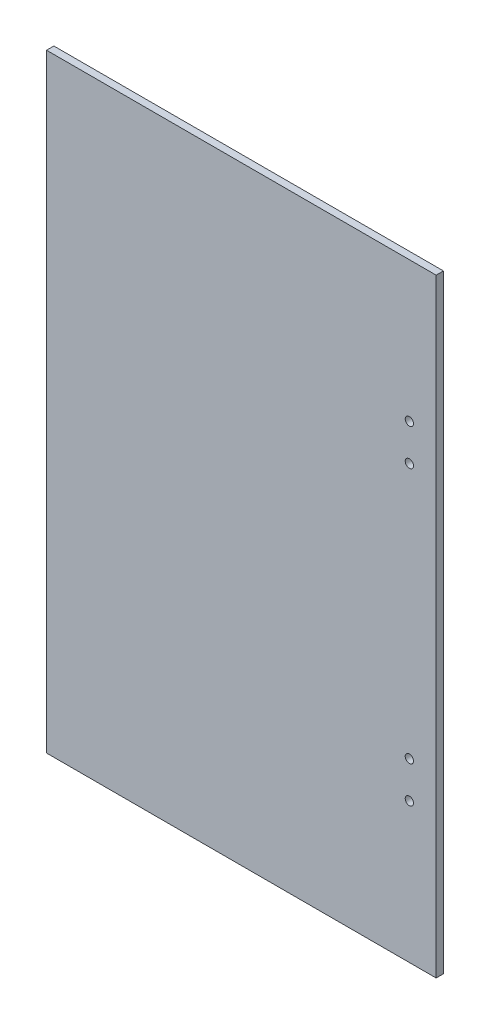
ISO-10303-21;
HEADER;
FILE_DESCRIPTION(('STEP AP214'),'2;1');
FILE_NAME('part.step','',(''),(''),'','','');
FILE_SCHEMA(('AUTOMOTIVE_DESIGN { 1 0 10303 214 1 1 1 1 }'));
ENDSEC;
DATA;
#1=APPLICATION_CONTEXT('core data for automotive mechanical design processes');
#2=APPLICATION_PROTOCOL_DEFINITION('international standard','automotive_design',2000,#1);
#3=PRODUCT_CONTEXT('',#1,'mechanical');
#4=PRODUCT('Part','Part','',(#3));
#5=PRODUCT_RELATED_PRODUCT_CATEGORY('part','',(#4));
#6=PRODUCT_DEFINITION_FORMATION('','',#4);
#7=PRODUCT_DEFINITION_CONTEXT('part definition',#1,'design');
#8=PRODUCT_DEFINITION('design','',#6,#7);
#9=PRODUCT_DEFINITION_SHAPE('','',#8);
#10=(LENGTH_UNIT() NAMED_UNIT(*) SI_UNIT(.MILLI.,.METRE.));
#11=(NAMED_UNIT(*) PLANE_ANGLE_UNIT() SI_UNIT($,.RADIAN.));
#12=(NAMED_UNIT(*) SI_UNIT($,.STERADIAN.) SOLID_ANGLE_UNIT());
#13=UNCERTAINTY_MEASURE_WITH_UNIT(LENGTH_MEASURE(1.E-05),#10,'distance_accuracy_value','');
#14=(GEOMETRIC_REPRESENTATION_CONTEXT(3) GLOBAL_UNCERTAINTY_ASSIGNED_CONTEXT((#13)) GLOBAL_UNIT_ASSIGNED_CONTEXT((#10,
#11,#12)) REPRESENTATION_CONTEXT('',''));
#15=CARTESIAN_POINT('',(0.,0.,0.));
#16=DIRECTION('',(0.,0.,1.));
#17=DIRECTION('',(1.,0.,0.));
#18=AXIS2_PLACEMENT_3D('',#15,#16,#17);
#19=CARTESIAN_POINT('',(80.,-125.,1.5));
#20=DIRECTION('',(-1.,0.,0.));
#21=DIRECTION('',(0.,0.,1.));
#22=AXIS2_PLACEMENT_3D('',#19,#20,#21);
#23=PLANE('',#22);
#24=DIRECTION('',(0.,1.,0.));
#25=VECTOR('',#24,1.);
#26=CARTESIAN_POINT('',(80.,-125.,-1.5));
#27=LINE('',#26,#25);
#28=CARTESIAN_POINT('',(80.,-125.,-1.5));
#29=VERTEX_POINT('',#28);
#30=CARTESIAN_POINT('',(80.,125.,-1.5));
#31=VERTEX_POINT('',#30);
#32=EDGE_CURVE('E102',#29,#31,#27,.T.);
#33=ORIENTED_EDGE('',*,*,#32,.T.);
#34=DIRECTION('',(0.,0.,-1.));
#35=VECTOR('',#34,1.);
#36=CARTESIAN_POINT('',(80.,125.,1.5));
#37=LINE('',#36,#35);
#38=CARTESIAN_POINT('',(80.,125.,1.5));
#39=VERTEX_POINT('',#38);
#40=EDGE_CURVE('E11',#39,#31,#37,.T.);
#41=ORIENTED_EDGE('',*,*,#40,.F.);
#42=DIRECTION('',(0.,1.,0.));
#43=VECTOR('',#42,1.);
#44=CARTESIAN_POINT('',(80.,-125.,1.5));
#45=LINE('',#44,#43);
#46=CARTESIAN_POINT('',(80.,-125.,1.5));
#47=VERTEX_POINT('',#46);
#48=EDGE_CURVE('E90',#47,#39,#45,.T.);
#49=ORIENTED_EDGE('',*,*,#48,.F.);
#50=DIRECTION('',(0.,0.,-1.));
#51=VECTOR('',#50,1.);
#52=CARTESIAN_POINT('',(80.,-125.,1.5));
#53=LINE('',#52,#51);
#54=EDGE_CURVE('E98',#47,#29,#53,.T.);
#55=ORIENTED_EDGE('',*,*,#54,.T.);
#56=EDGE_LOOP('',(#33,#41,#49,#55));
#57=FACE_BOUND('',#56,.T.);
#58=ADVANCED_FACE('F39',(#57),#23,.F.);
#59=CARTESIAN_POINT('',(-80.,125.,1.5));
#60=DIRECTION('',(0.,-1.,0.));
#61=DIRECTION('',(0.,0.,-1.));
#62=AXIS2_PLACEMENT_3D('',#59,#60,#61);
#63=PLANE('',#62);
#64=DIRECTION('',(-1.,0.,0.));
#65=VECTOR('',#64,1.);
#66=CARTESIAN_POINT('',(-80.,125.,-1.5));
#67=LINE('',#66,#65);
#68=CARTESIAN_POINT('',(-80.,125.,-1.5));
#69=VERTEX_POINT('',#68);
#70=EDGE_CURVE('E94',#31,#69,#67,.T.);
#71=ORIENTED_EDGE('',*,*,#70,.T.);
#72=DIRECTION('',(0.,0.,-1.));
#73=VECTOR('',#72,1.);
#74=CARTESIAN_POINT('',(-80.,125.,1.5));
#75=LINE('',#74,#73);
#76=CARTESIAN_POINT('',(-80.,125.,1.5));
#77=VERTEX_POINT('',#76);
#78=EDGE_CURVE('E47',#77,#69,#75,.T.);
#79=ORIENTED_EDGE('',*,*,#78,.F.);
#80=DIRECTION('',(-1.,0.,0.));
#81=VECTOR('',#80,1.);
#82=CARTESIAN_POINT('',(-80.,125.,1.5));
#83=LINE('',#82,#81);
#84=EDGE_CURVE('E85',#39,#77,#83,.T.);
#85=ORIENTED_EDGE('',*,*,#84,.F.);
#86=ORIENTED_EDGE('',*,*,#40,.T.);
#87=EDGE_LOOP('',(#71,#79,#85,#86));
#88=FACE_BOUND('',#87,.T.);
#89=ADVANCED_FACE('F93',(#88),#63,.F.);
#90=CARTESIAN_POINT('',(-80.,-125.,1.5));
#91=DIRECTION('',(1.,0.,0.));
#92=DIRECTION('',(0.,0.,-1.));
#93=AXIS2_PLACEMENT_3D('',#90,#91,#92);
#94=PLANE('',#93);
#95=DIRECTION('',(0.,-1.,0.));
#96=VECTOR('',#95,1.);
#97=CARTESIAN_POINT('',(-80.,-125.,-1.5));
#98=LINE('',#97,#96);
#99=CARTESIAN_POINT('',(-80.,-125.,-1.5));
#100=VERTEX_POINT('',#99);
#101=EDGE_CURVE('E72',#69,#100,#98,.T.);
#102=ORIENTED_EDGE('',*,*,#101,.T.);
#103=DIRECTION('',(0.,0.,-1.));
#104=VECTOR('',#103,1.);
#105=CARTESIAN_POINT('',(-80.,-125.,1.5));
#106=LINE('',#105,#104);
#107=CARTESIAN_POINT('',(-80.,-125.,1.5));
#108=VERTEX_POINT('',#107);
#109=EDGE_CURVE('E95',#108,#100,#106,.T.);
#110=ORIENTED_EDGE('',*,*,#109,.F.);
#111=DIRECTION('',(0.,-1.,0.));
#112=VECTOR('',#111,1.);
#113=CARTESIAN_POINT('',(-80.,-125.,1.5));
#114=LINE('',#113,#112);
#115=EDGE_CURVE('E88',#77,#108,#114,.T.);
#116=ORIENTED_EDGE('',*,*,#115,.F.);
#117=ORIENTED_EDGE('',*,*,#78,.T.);
#118=EDGE_LOOP('',(#102,#110,#116,#117));
#119=FACE_BOUND('',#118,.T.);
#120=ADVANCED_FACE('F96',(#119),#94,.F.);
#121=CARTESIAN_POINT('',(-80.,-125.,1.5));
#122=DIRECTION('',(0.,1.,0.));
#123=DIRECTION('',(0.,0.,1.));
#124=AXIS2_PLACEMENT_3D('',#121,#122,#123);
#125=PLANE('',#124);
#126=DIRECTION('',(1.,0.,0.));
#127=VECTOR('',#126,1.);
#128=CARTESIAN_POINT('',(-80.,-125.,-1.5));
#129=LINE('',#128,#127);
#130=EDGE_CURVE('E78',#100,#29,#129,.T.);
#131=ORIENTED_EDGE('',*,*,#130,.T.);
#132=ORIENTED_EDGE('',*,*,#54,.F.);
#133=DIRECTION('',(1.,0.,0.));
#134=VECTOR('',#133,1.);
#135=CARTESIAN_POINT('',(-80.,-125.,1.5));
#136=LINE('',#135,#134);
#137=EDGE_CURVE('E55',#108,#47,#136,.T.);
#138=ORIENTED_EDGE('',*,*,#137,.F.);
#139=ORIENTED_EDGE('',*,*,#109,.T.);
#140=EDGE_LOOP('',(#131,#132,#138,#139));
#141=FACE_BOUND('',#140,.T.);
#142=ADVANCED_FACE('F110',(#141),#125,.F.);
#143=CARTESIAN_POINT('',(0.,0.,1.5));
#144=DIRECTION('',(0.,0.,-1.));
#145=DIRECTION('',(-1.,0.,0.));
#146=AXIS2_PLACEMENT_3D('',#143,#144,#145);
#147=PLANE('',#146);
#148=CARTESIAN_POINT('',(69.,67.5,1.5));
#149=DIRECTION('',(0.,0.,1.));
#150=DIRECTION('',(1.,0.,0.));
#151=AXIS2_PLACEMENT_3D('',#148,#149,#150);
#152=CIRCLE('',#151,1.7);
#153=CARTESIAN_POINT('',(70.7,67.5,1.5));
#154=VERTEX_POINT('',#153);
#155=EDGE_CURVE('E134',#154,#154,#152,.T.);
#156=ORIENTED_EDGE('',*,*,#155,.F.);
#157=EDGE_LOOP('',(#156));
#158=FACE_BOUND('',#157,.T.);
#159=CARTESIAN_POINT('',(69.,52.5,1.5));
#160=DIRECTION('',(0.,0.,1.));
#161=DIRECTION('',(1.,0.,0.));
#162=AXIS2_PLACEMENT_3D('',#159,#160,#161);
#163=CIRCLE('',#162,1.7);
#164=CARTESIAN_POINT('',(70.7,52.5,1.5));
#165=VERTEX_POINT('',#164);
#166=EDGE_CURVE('E131',#165,#165,#163,.T.);
#167=ORIENTED_EDGE('',*,*,#166,.F.);
#168=EDGE_LOOP('',(#167));
#169=FACE_BOUND('',#168,.T.);
#170=CARTESIAN_POINT('',(69.,-52.5,1.5));
#171=DIRECTION('',(0.,0.,1.));
#172=DIRECTION('',(-1.,0.,0.));
#173=AXIS2_PLACEMENT_3D('',#170,#171,#172);
#174=CIRCLE('',#173,1.7);
#175=CARTESIAN_POINT('',(67.3,-52.5,1.5));
#176=VERTEX_POINT('',#175);
#177=EDGE_CURVE('E125',#176,#176,#174,.T.);
#178=ORIENTED_EDGE('',*,*,#177,.F.);
#179=EDGE_LOOP('',(#178));
#180=FACE_BOUND('',#179,.T.);
#181=CARTESIAN_POINT('',(69.,-67.5,1.5));
#182=DIRECTION('',(0.,0.,1.));
#183=DIRECTION('',(-1.,0.,0.));
#184=AXIS2_PLACEMENT_3D('',#181,#182,#183);
#185=CIRCLE('',#184,1.7);
#186=CARTESIAN_POINT('',(67.3,-67.5,1.5));
#187=VERTEX_POINT('',#186);
#188=EDGE_CURVE('E119',#187,#187,#185,.T.);
#189=ORIENTED_EDGE('',*,*,#188,.F.);
#190=EDGE_LOOP('',(#189));
#191=FACE_BOUND('',#190,.T.);
#192=ORIENTED_EDGE('',*,*,#48,.T.);
#193=ORIENTED_EDGE('',*,*,#84,.T.);
#194=ORIENTED_EDGE('',*,*,#115,.T.);
#195=ORIENTED_EDGE('',*,*,#137,.T.);
#196=EDGE_LOOP('',(#192,#193,#194,#195));
#197=FACE_BOUND('',#196,.T.);
#198=ADVANCED_FACE('F86',(#158,#169,#180,#191,#197),#147,.F.);
#199=CARTESIAN_POINT('',(0.,0.,-1.5));
#200=DIRECTION('',(0.,0.,-1.));
#201=DIRECTION('',(-1.,0.,0.));
#202=AXIS2_PLACEMENT_3D('',#199,#200,#201);
#203=PLANE('',#202);
#204=CARTESIAN_POINT('',(69.,67.5,-1.5));
#205=DIRECTION('',(0.,0.,1.));
#206=DIRECTION('',(1.,0.,0.));
#207=AXIS2_PLACEMENT_3D('',#204,#205,#206);
#208=CIRCLE('',#207,1.7);
#209=CARTESIAN_POINT('',(70.7,67.5,-1.5));
#210=VERTEX_POINT('',#209);
#211=EDGE_CURVE('E105',#210,#210,#208,.T.);
#212=ORIENTED_EDGE('',*,*,#211,.T.);
#213=EDGE_LOOP('',(#212));
#214=FACE_BOUND('',#213,.T.);
#215=CARTESIAN_POINT('',(69.,52.5,-1.5));
#216=DIRECTION('',(0.,0.,1.));
#217=DIRECTION('',(1.,0.,0.));
#218=AXIS2_PLACEMENT_3D('',#215,#216,#217);
#219=CIRCLE('',#218,1.7);
#220=CARTESIAN_POINT('',(70.7,52.5,-1.5));
#221=VERTEX_POINT('',#220);
#222=EDGE_CURVE('E128',#221,#221,#219,.T.);
#223=ORIENTED_EDGE('',*,*,#222,.T.);
#224=EDGE_LOOP('',(#223));
#225=FACE_BOUND('',#224,.T.);
#226=CARTESIAN_POINT('',(69.,-52.5,-1.5));
#227=DIRECTION('',(0.,0.,1.));
#228=DIRECTION('',(-1.,0.,0.));
#229=AXIS2_PLACEMENT_3D('',#226,#227,#228);
#230=CIRCLE('',#229,1.7);
#231=CARTESIAN_POINT('',(67.3,-52.5,-1.5));
#232=VERTEX_POINT('',#231);
#233=EDGE_CURVE('E122',#232,#232,#230,.T.);
#234=ORIENTED_EDGE('',*,*,#233,.T.);
#235=EDGE_LOOP('',(#234));
#236=FACE_BOUND('',#235,.T.);
#237=CARTESIAN_POINT('',(69.,-67.5,-1.5));
#238=DIRECTION('',(0.,0.,1.));
#239=DIRECTION('',(-1.,0.,0.));
#240=AXIS2_PLACEMENT_3D('',#237,#238,#239);
#241=CIRCLE('',#240,1.7);
#242=CARTESIAN_POINT('',(67.3,-67.5,-1.5));
#243=VERTEX_POINT('',#242);
#244=EDGE_CURVE('E116',#243,#243,#241,.T.);
#245=ORIENTED_EDGE('',*,*,#244,.T.);
#246=EDGE_LOOP('',(#245));
#247=FACE_BOUND('',#246,.T.);
#248=ORIENTED_EDGE('',*,*,#32,.F.);
#249=ORIENTED_EDGE('',*,*,#130,.F.);
#250=ORIENTED_EDGE('',*,*,#101,.F.);
#251=ORIENTED_EDGE('',*,*,#70,.F.);
#252=EDGE_LOOP('',(#248,#249,#250,#251));
#253=FACE_BOUND('',#252,.T.);
#254=ADVANCED_FACE('F113',(#214,#225,#236,#247,#253),#203,.T.);
#255=CARTESIAN_POINT('',(69.,-67.5,-1.5));
#256=DIRECTION('',(0.,0.,1.));
#257=DIRECTION('',(1.,0.,0.));
#258=AXIS2_PLACEMENT_3D('',#255,#256,#257);
#259=CYLINDRICAL_SURFACE('',#258,1.7);
#260=ORIENTED_EDGE('',*,*,#244,.F.);
#261=EDGE_LOOP('',(#260));
#262=FACE_BOUND('',#261,.T.);
#263=ORIENTED_EDGE('',*,*,#188,.T.);
#264=EDGE_LOOP('',(#263));
#265=FACE_BOUND('',#264,.T.);
#266=ADVANCED_FACE('F158',(#262,#265),#259,.F.);
#267=CARTESIAN_POINT('',(69.,-52.5,-1.5));
#268=DIRECTION('',(0.,0.,1.));
#269=DIRECTION('',(1.,0.,0.));
#270=AXIS2_PLACEMENT_3D('',#267,#268,#269);
#271=CYLINDRICAL_SURFACE('',#270,1.7);
#272=ORIENTED_EDGE('',*,*,#233,.F.);
#273=EDGE_LOOP('',(#272));
#274=FACE_BOUND('',#273,.T.);
#275=ORIENTED_EDGE('',*,*,#177,.T.);
#276=EDGE_LOOP('',(#275));
#277=FACE_BOUND('',#276,.T.);
#278=ADVANCED_FACE('F160',(#274,#277),#271,.F.);
#279=CARTESIAN_POINT('',(69.,52.5,-1.5));
#280=DIRECTION('',(0.,0.,1.));
#281=DIRECTION('',(1.,0.,0.));
#282=AXIS2_PLACEMENT_3D('',#279,#280,#281);
#283=CYLINDRICAL_SURFACE('',#282,1.7);
#284=ORIENTED_EDGE('',*,*,#222,.F.);
#285=EDGE_LOOP('',(#284));
#286=FACE_BOUND('',#285,.T.);
#287=ORIENTED_EDGE('',*,*,#166,.T.);
#288=EDGE_LOOP('',(#287));
#289=FACE_BOUND('',#288,.T.);
#290=ADVANCED_FACE('F145',(#286,#289),#283,.F.);
#291=CARTESIAN_POINT('',(69.,67.5,-1.5));
#292=DIRECTION('',(0.,0.,1.));
#293=DIRECTION('',(1.,0.,0.));
#294=AXIS2_PLACEMENT_3D('',#291,#292,#293);
#295=CYLINDRICAL_SURFACE('',#294,1.7);
#296=ORIENTED_EDGE('',*,*,#211,.F.);
#297=EDGE_LOOP('',(#296));
#298=FACE_BOUND('',#297,.T.);
#299=ORIENTED_EDGE('',*,*,#155,.T.);
#300=EDGE_LOOP('',(#299));
#301=FACE_BOUND('',#300,.T.);
#302=ADVANCED_FACE('F142',(#298,#301),#295,.F.);
#303=CLOSED_SHELL('',(#58,#89,#120,#142,#198,#254,#266,#278,#290,#302));
#304=MANIFOLD_SOLID_BREP('B2',#303);
#305=ADVANCED_BREP_SHAPE_REPRESENTATION('',(#18,#304),#14);
#306=SHAPE_DEFINITION_REPRESENTATION(#9,#305);
ENDSEC;
END-ISO-10303-21;
